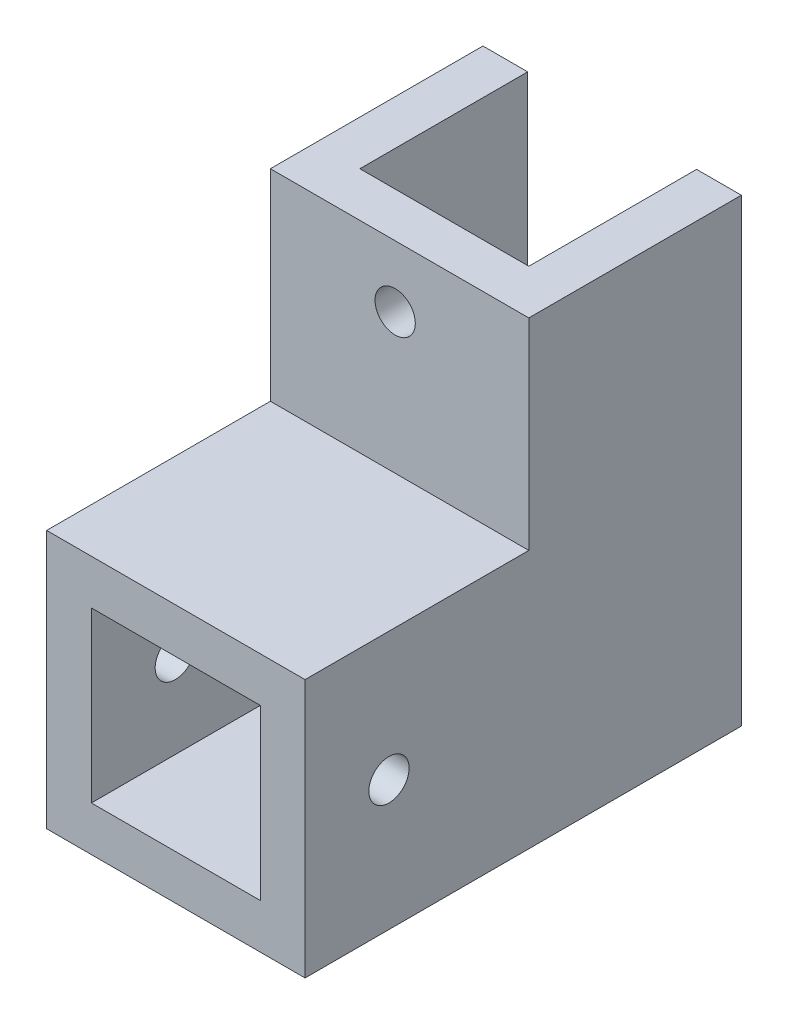
ISO-10303-21;
HEADER;
FILE_DESCRIPTION(('STEP AP214'),'2;1');
FILE_NAME('part.step','',(''),(''),'','','');
FILE_SCHEMA(('AUTOMOTIVE_DESIGN { 1 0 10303 214 1 1 1 1 }'));
ENDSEC;
DATA;
#1=APPLICATION_CONTEXT('core data for automotive mechanical design processes');
#2=APPLICATION_PROTOCOL_DEFINITION('international standard','automotive_design',2000,#1);
#3=PRODUCT_CONTEXT('',#1,'mechanical');
#4=PRODUCT('Part','Part','',(#3));
#5=PRODUCT_RELATED_PRODUCT_CATEGORY('part','',(#4));
#6=PRODUCT_DEFINITION_FORMATION('','',#4);
#7=PRODUCT_DEFINITION_CONTEXT('part definition',#1,'design');
#8=PRODUCT_DEFINITION('design','',#6,#7);
#9=PRODUCT_DEFINITION_SHAPE('','',#8);
#10=(LENGTH_UNIT() NAMED_UNIT(*) SI_UNIT(.MILLI.,.METRE.));
#11=(NAMED_UNIT(*) PLANE_ANGLE_UNIT() SI_UNIT($,.RADIAN.));
#12=(NAMED_UNIT(*) SI_UNIT($,.STERADIAN.) SOLID_ANGLE_UNIT());
#13=UNCERTAINTY_MEASURE_WITH_UNIT(LENGTH_MEASURE(1.E-05),#10,'distance_accuracy_value','');
#14=(GEOMETRIC_REPRESENTATION_CONTEXT(3) GLOBAL_UNCERTAINTY_ASSIGNED_CONTEXT((#13)) GLOBAL_UNIT_ASSIGNED_CONTEXT((#10,
#11,#12)) REPRESENTATION_CONTEXT('',''));
#15=CARTESIAN_POINT('',(0.,0.,0.));
#16=DIRECTION('',(0.,0.,1.));
#17=DIRECTION('',(1.,0.,0.));
#18=AXIS2_PLACEMENT_3D('',#15,#16,#17);
#19=CARTESIAN_POINT('',(-7.15384615384616,20.,0.730769230769229));
#20=DIRECTION('',(0.,0.,1.));
#21=DIRECTION('',(1.,0.,0.));
#22=AXIS2_PLACEMENT_3D('',#19,#20,#21);
#23=PLANE('',#22);
#24=CARTESIAN_POINT('',(0.,12.5,0.730769230769229));
#25=DIRECTION('',(0.,0.,1.));
#26=DIRECTION('',(1.,0.,0.));
#27=AXIS2_PLACEMENT_3D('',#24,#25,#26);
#28=CIRCLE('',#27,1.8);
#29=CARTESIAN_POINT('',(1.8,12.5,0.730769230769229));
#30=VERTEX_POINT('',#29);
#31=EDGE_CURVE('E300',#30,#30,#28,.T.);
#32=ORIENTED_EDGE('',*,*,#31,.T.);
#33=EDGE_LOOP('',(#32));
#34=FACE_BOUND('',#33,.T.);
#35=DIRECTION('',(-1.,0.,0.));
#36=VECTOR('',#35,1.);
#37=CARTESIAN_POINT('',(-7.15384615384616,18.,0.730769230769229));
#38=LINE('',#37,#36);
#39=CARTESIAN_POINT('',(7.94615384615384,18.,0.730769230769229));
#40=VERTEX_POINT('',#39);
#41=CARTESIAN_POINT('',(-7.15384615384616,18.,0.730769230769229));
#42=VERTEX_POINT('',#41);
#43=EDGE_CURVE('E324',#40,#42,#38,.T.);
#44=ORIENTED_EDGE('',*,*,#43,.F.);
#45=DIRECTION('',(0.,-1.,0.));
#46=VECTOR('',#45,1.);
#47=CARTESIAN_POINT('',(7.94615384615384,20.,0.730769230769229));
#48=LINE('',#47,#46);
#49=CARTESIAN_POINT('',(7.94615384615385,-4.,0.730769230769229));
#50=VERTEX_POINT('',#49);
#51=EDGE_CURVE('E191',#40,#50,#48,.T.);
#52=ORIENTED_EDGE('',*,*,#51,.T.);
#53=DIRECTION('',(1.,0.,0.));
#54=VECTOR('',#53,1.);
#55=CARTESIAN_POINT('',(7.94615384615384,-4.,0.730769230769229));
#56=LINE('',#55,#54);
#57=CARTESIAN_POINT('',(-7.15384615384616,-4.,0.730769230769229));
#58=VERTEX_POINT('',#57);
#59=EDGE_CURVE('E238',#58,#50,#56,.T.);
#60=ORIENTED_EDGE('',*,*,#59,.F.);
#61=DIRECTION('',(0.,-1.,0.));
#62=VECTOR('',#61,1.);
#63=CARTESIAN_POINT('',(-7.15384615384616,20.,0.730769230769229));
#64=LINE('',#63,#62);
#65=EDGE_CURVE('E188',#42,#58,#64,.T.);
#66=ORIENTED_EDGE('',*,*,#65,.F.);
#67=EDGE_LOOP('',(#44,#52,#60,#66));
#68=FACE_BOUND('',#67,.T.);
#69=ADVANCED_FACE('F38',(#34,#68),#23,.F.);
#70=CARTESIAN_POINT('',(-11.1538461538462,20.,-14.2692307692308));
#71=DIRECTION('',(1.,0.,0.));
#72=DIRECTION('',(0.,0.,-1.));
#73=AXIS2_PLACEMENT_3D('',#70,#71,#72);
#74=PLANE('',#73);
#75=CARTESIAN_POINT('',(-11.1538461538462,-11.5,17.2307692307692));
#76=DIRECTION('',(1.,0.,0.));
#77=DIRECTION('',(0.,0.,-1.));
#78=AXIS2_PLACEMENT_3D('',#75,#76,#77);
#79=CIRCLE('',#78,1.8);
#80=CARTESIAN_POINT('',(-11.1538461538462,-11.5,15.4307692307692));
#81=VERTEX_POINT('',#80);
#82=EDGE_CURVE('E309',#81,#81,#79,.T.);
#83=ORIENTED_EDGE('',*,*,#82,.T.);
#84=EDGE_LOOP('',(#83));
#85=FACE_BOUND('',#84,.T.);
#86=DIRECTION('',(0.,0.,1.));
#87=VECTOR('',#86,1.);
#88=CARTESIAN_POINT('',(-11.1538461538462,18.,-14.2692307692308));
#89=LINE('',#88,#87);
#90=CARTESIAN_POINT('',(-11.1538461538462,18.,-14.2692307692308));
#91=VERTEX_POINT('',#90);
#92=CARTESIAN_POINT('',(-11.1538461538462,18.,4.73076923076923));
#93=VERTEX_POINT('',#92);
#94=EDGE_CURVE('E138',#91,#93,#89,.T.);
#95=ORIENTED_EDGE('',*,*,#94,.F.);
#96=DIRECTION('',(0.,-1.,0.));
#97=VECTOR('',#96,1.);
#98=CARTESIAN_POINT('',(-11.1538461538462,20.,-14.2692307692308));
#99=LINE('',#98,#97);
#100=CARTESIAN_POINT('',(-11.1538461538462,-23.1,-14.2692307692308));
#101=VERTEX_POINT('',#100);
#102=EDGE_CURVE('E182',#91,#101,#99,.T.);
#103=ORIENTED_EDGE('',*,*,#102,.T.);
#104=DIRECTION('',(0.,0.,-1.));
#105=VECTOR('',#104,1.);
#106=CARTESIAN_POINT('',(-11.1538461538462,-23.1,24.7307692307692));
#107=LINE('',#106,#105);
#108=CARTESIAN_POINT('',(-11.1538461538462,-23.1,24.7307692307692));
#109=VERTEX_POINT('',#108);
#110=EDGE_CURVE('E164',#109,#101,#107,.T.);
#111=ORIENTED_EDGE('',*,*,#110,.F.);
#112=DIRECTION('',(0.,1.,0.));
#113=VECTOR('',#112,1.);
#114=CARTESIAN_POINT('',(-11.1538461538462,0.,24.7307692307692));
#115=LINE('',#114,#113);
#116=CARTESIAN_POINT('',(-11.1538461538462,0.,24.7307692307692));
#117=VERTEX_POINT('',#116);
#118=EDGE_CURVE('E158',#109,#117,#115,.T.);
#119=ORIENTED_EDGE('',*,*,#118,.T.);
#120=DIRECTION('',(0.,0.,-1.));
#121=VECTOR('',#120,1.);
#122=CARTESIAN_POINT('',(-11.1538461538462,0.,24.7307692307692));
#123=LINE('',#122,#121);
#124=CARTESIAN_POINT('',(-11.1538461538462,0.,4.73076923076923));
#125=VERTEX_POINT('',#124);
#126=EDGE_CURVE('E156',#117,#125,#123,.T.);
#127=ORIENTED_EDGE('',*,*,#126,.T.);
#128=DIRECTION('',(0.,-1.,0.));
#129=VECTOR('',#128,1.);
#130=CARTESIAN_POINT('',(-11.1538461538462,20.,4.73076923076923));
#131=LINE('',#130,#129);
#132=EDGE_CURVE('E11',#93,#125,#131,.T.);
#133=ORIENTED_EDGE('',*,*,#132,.F.);
#134=EDGE_LOOP('',(#95,#103,#111,#119,#127,#133));
#135=FACE_BOUND('',#134,.T.);
#136=ADVANCED_FACE('F40',(#85,#135),#74,.F.);
#137=CARTESIAN_POINT('',(-7.38461538461538,20.,4.73076923076923));
#138=DIRECTION('',(0.,0.,-1.));
#139=DIRECTION('',(-1.,0.,0.));
#140=AXIS2_PLACEMENT_3D('',#137,#138,#139);
#141=PLANE('',#140);
#142=CARTESIAN_POINT('',(0.,12.5,4.73076923076923));
#143=DIRECTION('',(0.,0.,1.));
#144=DIRECTION('',(1.,0.,0.));
#145=AXIS2_PLACEMENT_3D('',#142,#143,#144);
#146=CIRCLE('',#145,1.8);
#147=CARTESIAN_POINT('',(1.8,12.5,4.73076923076923));
#148=VERTEX_POINT('',#147);
#149=EDGE_CURVE('E305',#148,#148,#146,.T.);
#150=ORIENTED_EDGE('',*,*,#149,.F.);
#151=EDGE_LOOP('',(#150));
#152=FACE_BOUND('',#151,.T.);
#153=DIRECTION('',(1.,0.,0.));
#154=VECTOR('',#153,1.);
#155=CARTESIAN_POINT('',(-11.1538461538462,18.,4.73076923076923));
#156=LINE('',#155,#154);
#157=CARTESIAN_POINT('',(11.9461538461538,18.,4.73076923076923));
#158=VERTEX_POINT('',#157);
#159=EDGE_CURVE('E141',#93,#158,#156,.T.);
#160=ORIENTED_EDGE('',*,*,#159,.F.);
#161=ORIENTED_EDGE('',*,*,#132,.T.);
#162=DIRECTION('',(1.,0.,0.));
#163=VECTOR('',#162,1.);
#164=CARTESIAN_POINT('',(-7.38461538461538,0.,4.73076923076923));
#165=LINE('',#164,#163);
#166=CARTESIAN_POINT('',(11.9461538461538,0.,4.73076923076923));
#167=VERTEX_POINT('',#166);
#168=EDGE_CURVE('E169',#125,#167,#165,.T.);
#169=ORIENTED_EDGE('',*,*,#168,.T.);
#170=DIRECTION('',(0.,-1.,0.));
#171=VECTOR('',#170,1.);
#172=CARTESIAN_POINT('',(11.9461538461538,20.,4.73076923076923));
#173=LINE('',#172,#171);
#174=EDGE_CURVE('E48',#158,#167,#173,.T.);
#175=ORIENTED_EDGE('',*,*,#174,.F.);
#176=EDGE_LOOP('',(#160,#161,#169,#175));
#177=FACE_BOUND('',#176,.T.);
#178=ADVANCED_FACE('F149',(#152,#177),#141,.F.);
#179=CARTESIAN_POINT('',(11.9461538461538,20.,0.730769230769228));
#180=DIRECTION('',(-1.,0.,0.));
#181=DIRECTION('',(0.,0.,1.));
#182=AXIS2_PLACEMENT_3D('',#179,#180,#181);
#183=PLANE('',#182);
#184=CARTESIAN_POINT('',(11.9461538461538,-11.5,17.2307692307692));
#185=DIRECTION('',(1.,0.,0.));
#186=DIRECTION('',(0.,0.,-1.));
#187=AXIS2_PLACEMENT_3D('',#184,#185,#186);
#188=CIRCLE('',#187,1.8);
#189=CARTESIAN_POINT('',(11.9461538461538,-11.5,15.4307692307692));
#190=VERTEX_POINT('',#189);
#191=EDGE_CURVE('E317',#190,#190,#188,.T.);
#192=ORIENTED_EDGE('',*,*,#191,.F.);
#193=EDGE_LOOP('',(#192));
#194=FACE_BOUND('',#193,.T.);
#195=DIRECTION('',(0.,0.,-1.));
#196=VECTOR('',#195,1.);
#197=CARTESIAN_POINT('',(11.9461538461538,18.,-14.2692307692308));
#198=LINE('',#197,#196);
#199=CARTESIAN_POINT('',(11.9461538461538,18.,-14.2692307692308));
#200=VERTEX_POINT('',#199);
#201=EDGE_CURVE('E152',#158,#200,#198,.T.);
#202=ORIENTED_EDGE('',*,*,#201,.F.);
#203=ORIENTED_EDGE('',*,*,#174,.T.);
#204=DIRECTION('',(0.,0.,-1.));
#205=VECTOR('',#204,1.);
#206=CARTESIAN_POINT('',(11.9461538461538,0.,24.7307692307692));
#207=LINE('',#206,#205);
#208=CARTESIAN_POINT('',(11.9461538461538,0.,24.7307692307692));
#209=VERTEX_POINT('',#208);
#210=EDGE_CURVE('E163',#209,#167,#207,.T.);
#211=ORIENTED_EDGE('',*,*,#210,.F.);
#212=DIRECTION('',(0.,-1.,0.));
#213=VECTOR('',#212,1.);
#214=CARTESIAN_POINT('',(11.9461538461538,0.,24.7307692307692));
#215=LINE('',#214,#213);
#216=CARTESIAN_POINT('',(11.9461538461538,-23.1,24.7307692307692));
#217=VERTEX_POINT('',#216);
#218=EDGE_CURVE('E214',#209,#217,#215,.T.);
#219=ORIENTED_EDGE('',*,*,#218,.T.);
#220=DIRECTION('',(0.,0.,-1.));
#221=VECTOR('',#220,1.);
#222=CARTESIAN_POINT('',(11.9461538461538,-23.1,24.7307692307692));
#223=LINE('',#222,#221);
#224=CARTESIAN_POINT('',(11.9461538461538,-23.1,-14.2692307692308));
#225=VERTEX_POINT('',#224);
#226=EDGE_CURVE('E172',#217,#225,#223,.T.);
#227=ORIENTED_EDGE('',*,*,#226,.T.);
#228=DIRECTION('',(0.,-1.,0.));
#229=VECTOR('',#228,1.);
#230=CARTESIAN_POINT('',(11.9461538461538,20.,-14.2692307692308));
#231=LINE('',#230,#229);
#232=EDGE_CURVE('E197',#200,#225,#231,.T.);
#233=ORIENTED_EDGE('',*,*,#232,.F.);
#234=EDGE_LOOP('',(#202,#203,#211,#219,#227,#233));
#235=FACE_BOUND('',#234,.T.);
#236=ADVANCED_FACE('F212',(#194,#235),#183,.F.);
#237=CARTESIAN_POINT('',(11.9461538461538,20.,-14.2692307692308));
#238=DIRECTION('',(0.,0.,1.));
#239=DIRECTION('',(1.,0.,0.));
#240=AXIS2_PLACEMENT_3D('',#237,#238,#239);
#241=PLANE('',#240);
#242=DIRECTION('',(-1.,0.,0.));
#243=VECTOR('',#242,1.);
#244=CARTESIAN_POINT('',(-11.1538461538462,18.,-14.2692307692308));
#245=LINE('',#244,#243);
#246=CARTESIAN_POINT('',(7.94615384615384,18.,-14.2692307692308));
#247=VERTEX_POINT('',#246);
#248=EDGE_CURVE('E210',#200,#247,#245,.T.);
#249=ORIENTED_EDGE('',*,*,#248,.F.);
#250=ORIENTED_EDGE('',*,*,#232,.T.);
#251=DIRECTION('',(-1.,0.,0.));
#252=VECTOR('',#251,1.);
#253=CARTESIAN_POINT('',(11.9461538461538,-23.1,-14.2692307692308));
#254=LINE('',#253,#252);
#255=CARTESIAN_POINT('',(7.94615384615384,-23.1,-14.2692307692308));
#256=VERTEX_POINT('',#255);
#257=EDGE_CURVE('E208',#225,#256,#254,.T.);
#258=ORIENTED_EDGE('',*,*,#257,.T.);
#259=DIRECTION('',(0.,-1.,0.));
#260=VECTOR('',#259,1.);
#261=CARTESIAN_POINT('',(7.94615384615384,20.,-14.2692307692308));
#262=LINE('',#261,#260);
#263=EDGE_CURVE('E194',#247,#256,#262,.T.);
#264=ORIENTED_EDGE('',*,*,#263,.F.);
#265=EDGE_LOOP('',(#249,#250,#258,#264));
#266=FACE_BOUND('',#265,.T.);
#267=ADVANCED_FACE('F205',(#266),#241,.F.);
#268=CARTESIAN_POINT('',(7.94615384615384,20.,0.730769230769229));
#269=DIRECTION('',(1.,0.,0.));
#270=DIRECTION('',(0.,0.,-1.));
#271=AXIS2_PLACEMENT_3D('',#268,#269,#270);
#272=PLANE('',#271);
#273=CARTESIAN_POINT('',(7.94615384615384,-11.5,17.2307692307692));
#274=DIRECTION('',(1.,0.,0.));
#275=DIRECTION('',(0.,0.,-1.));
#276=AXIS2_PLACEMENT_3D('',#273,#274,#275);
#277=CIRCLE('',#276,1.8);
#278=CARTESIAN_POINT('',(7.94615384615384,-11.5,15.4307692307692));
#279=VERTEX_POINT('',#278);
#280=EDGE_CURVE('E313',#279,#279,#277,.T.);
#281=ORIENTED_EDGE('',*,*,#280,.T.);
#282=EDGE_LOOP('',(#281));
#283=FACE_BOUND('',#282,.T.);
#284=DIRECTION('',(0.,0.,1.));
#285=VECTOR('',#284,1.);
#286=CARTESIAN_POINT('',(7.94615384615384,18.,0.730769230769229));
#287=LINE('',#286,#285);
#288=EDGE_CURVE('E321',#247,#40,#287,.T.);
#289=ORIENTED_EDGE('',*,*,#288,.F.);
#290=ORIENTED_EDGE('',*,*,#263,.T.);
#291=DIRECTION('',(0.,0.,1.));
#292=VECTOR('',#291,1.);
#293=CARTESIAN_POINT('',(7.94615384615384,-23.1,-14.2692307692308));
#294=LINE('',#293,#292);
#295=CARTESIAN_POINT('',(7.94615384615384,-23.1,0.730769230769229));
#296=VERTEX_POINT('',#295);
#297=EDGE_CURVE('E220',#256,#296,#294,.T.);
#298=ORIENTED_EDGE('',*,*,#297,.T.);
#299=DIRECTION('',(0.,1.,0.));
#300=VECTOR('',#299,1.);
#301=CARTESIAN_POINT('',(7.94615384615385,0.,0.730769230769229));
#302=LINE('',#301,#300);
#303=CARTESIAN_POINT('',(7.94615384615384,-19.1,0.730769230769229));
#304=VERTEX_POINT('',#303);
#305=EDGE_CURVE('E222',#296,#304,#302,.T.);
#306=ORIENTED_EDGE('',*,*,#305,.T.);
#307=DIRECTION('',(0.,0.,-1.));
#308=VECTOR('',#307,1.);
#309=CARTESIAN_POINT('',(7.94615384615384,-19.1,24.7307692307692));
#310=LINE('',#309,#308);
#311=CARTESIAN_POINT('',(7.94615384615384,-19.1,24.7307692307692));
#312=VERTEX_POINT('',#311);
#313=EDGE_CURVE('E250',#312,#304,#310,.T.);
#314=ORIENTED_EDGE('',*,*,#313,.F.);
#315=DIRECTION('',(0.,-1.,0.));
#316=VECTOR('',#315,1.);
#317=CARTESIAN_POINT('',(7.94615384615384,-4.,24.7307692307692));
#318=LINE('',#317,#316);
#319=CARTESIAN_POINT('',(7.94615384615384,-4.,24.7307692307692));
#320=VERTEX_POINT('',#319);
#321=EDGE_CURVE('E233',#320,#312,#318,.T.);
#322=ORIENTED_EDGE('',*,*,#321,.F.);
#323=DIRECTION('',(0.,0.,-1.));
#324=VECTOR('',#323,1.);
#325=CARTESIAN_POINT('',(7.94615384615384,-4.,24.7307692307692));
#326=LINE('',#325,#324);
#327=EDGE_CURVE('E257',#320,#50,#326,.T.);
#328=ORIENTED_EDGE('',*,*,#327,.T.);
#329=ORIENTED_EDGE('',*,*,#51,.F.);
#330=EDGE_LOOP('',(#289,#290,#298,#306,#314,#322,#328,#329));
#331=FACE_BOUND('',#330,.T.);
#332=ADVANCED_FACE('F374',(#283,#331),#272,.F.);
#333=CARTESIAN_POINT('',(-7.15384615384616,20.,-14.2692307692308));
#334=DIRECTION('',(-1.,0.,0.));
#335=DIRECTION('',(0.,0.,1.));
#336=AXIS2_PLACEMENT_3D('',#333,#334,#335);
#337=PLANE('',#336);
#338=CARTESIAN_POINT('',(-7.15384615384615,-11.5,17.2307692307692));
#339=DIRECTION('',(-1.,0.,0.));
#340=DIRECTION('',(0.,0.,1.));
#341=AXIS2_PLACEMENT_3D('',#338,#339,#340);
#342=CIRCLE('',#341,1.8);
#343=CARTESIAN_POINT('',(-7.15384615384615,-11.5,19.0307692307692));
#344=VERTEX_POINT('',#343);
#345=EDGE_CURVE('E42',#344,#344,#342,.T.);
#346=ORIENTED_EDGE('',*,*,#345,.T.);
#347=EDGE_LOOP('',(#346));
#348=FACE_BOUND('',#347,.T.);
#349=DIRECTION('',(0.,0.,-1.));
#350=VECTOR('',#349,1.);
#351=CARTESIAN_POINT('',(-7.15384615384616,18.,-14.2692307692308));
#352=LINE('',#351,#350);
#353=CARTESIAN_POINT('',(-7.15384615384616,18.,-14.2692307692308));
#354=VERTEX_POINT('',#353);
#355=EDGE_CURVE('E55',#42,#354,#352,.T.);
#356=ORIENTED_EDGE('',*,*,#355,.F.);
#357=ORIENTED_EDGE('',*,*,#65,.T.);
#358=DIRECTION('',(0.,0.,-1.));
#359=VECTOR('',#358,1.);
#360=CARTESIAN_POINT('',(-7.15384615384616,-4.,24.7307692307692));
#361=LINE('',#360,#359);
#362=CARTESIAN_POINT('',(-7.15384615384616,-4.,24.7307692307692));
#363=VERTEX_POINT('',#362);
#364=EDGE_CURVE('E262',#363,#58,#361,.T.);
#365=ORIENTED_EDGE('',*,*,#364,.F.);
#366=DIRECTION('',(0.,1.,0.));
#367=VECTOR('',#366,1.);
#368=CARTESIAN_POINT('',(-7.15384615384616,-4.,24.7307692307692));
#369=LINE('',#368,#367);
#370=CARTESIAN_POINT('',(-7.15384615384616,-19.1,24.7307692307692));
#371=VERTEX_POINT('',#370);
#372=EDGE_CURVE('E242',#371,#363,#369,.T.);
#373=ORIENTED_EDGE('',*,*,#372,.F.);
#374=DIRECTION('',(0.,0.,-1.));
#375=VECTOR('',#374,1.);
#376=CARTESIAN_POINT('',(-7.15384615384616,-19.1,24.7307692307692));
#377=LINE('',#376,#375);
#378=CARTESIAN_POINT('',(-7.15384615384616,-19.1,0.730769230769229));
#379=VERTEX_POINT('',#378);
#380=EDGE_CURVE('E266',#371,#379,#377,.T.);
#381=ORIENTED_EDGE('',*,*,#380,.T.);
#382=DIRECTION('',(0.,-1.,0.));
#383=VECTOR('',#382,1.);
#384=CARTESIAN_POINT('',(-7.15384615384616,0.,0.730769230769229));
#385=LINE('',#384,#383);
#386=CARTESIAN_POINT('',(-7.15384615384616,-23.1,0.730769230769229));
#387=VERTEX_POINT('',#386);
#388=EDGE_CURVE('E287',#379,#387,#385,.T.);
#389=ORIENTED_EDGE('',*,*,#388,.T.);
#390=DIRECTION('',(0.,0.,1.));
#391=VECTOR('',#390,1.);
#392=CARTESIAN_POINT('',(-7.15384615384616,-23.1,-14.2692307692308));
#393=LINE('',#392,#391);
#394=CARTESIAN_POINT('',(-7.15384615384616,-23.1,-14.2692307692308));
#395=VERTEX_POINT('',#394);
#396=EDGE_CURVE('E228',#395,#387,#393,.T.);
#397=ORIENTED_EDGE('',*,*,#396,.F.);
#398=DIRECTION('',(0.,-1.,0.));
#399=VECTOR('',#398,1.);
#400=CARTESIAN_POINT('',(-7.15384615384616,20.,-14.2692307692308));
#401=LINE('',#400,#399);
#402=EDGE_CURVE('E185',#354,#395,#401,.T.);
#403=ORIENTED_EDGE('',*,*,#402,.F.);
#404=EDGE_LOOP('',(#356,#357,#365,#373,#381,#389,#397,#403));
#405=FACE_BOUND('',#404,.T.);
#406=ADVANCED_FACE('F337',(#348,#405),#337,.F.);
#407=CARTESIAN_POINT('',(-11.1538461538462,20.,-14.2692307692308));
#408=DIRECTION('',(0.,0.,1.));
#409=DIRECTION('',(1.,0.,0.));
#410=AXIS2_PLACEMENT_3D('',#407,#408,#409);
#411=PLANE('',#410);
#412=EDGE_CURVE('E142',#354,#91,#245,.T.);
#413=ORIENTED_EDGE('',*,*,#412,.F.);
#414=ORIENTED_EDGE('',*,*,#402,.T.);
#415=DIRECTION('',(-1.,0.,0.));
#416=VECTOR('',#415,1.);
#417=CARTESIAN_POINT('',(-11.1538461538462,-23.1,-14.2692307692308));
#418=LINE('',#417,#416);
#419=EDGE_CURVE('E292',#395,#101,#418,.T.);
#420=ORIENTED_EDGE('',*,*,#419,.T.);
#421=ORIENTED_EDGE('',*,*,#102,.F.);
#422=EDGE_LOOP('',(#413,#414,#420,#421));
#423=FACE_BOUND('',#422,.T.);
#424=ADVANCED_FACE('F363',(#423),#411,.F.);
#425=ORIENTED_EDGE('',*,*,#388,.F.);
#426=DIRECTION('',(-1.,0.,0.));
#427=VECTOR('',#426,1.);
#428=CARTESIAN_POINT('',(7.94615384615384,-19.1,0.730769230769229));
#429=LINE('',#428,#427);
#430=EDGE_CURVE('E226',#304,#379,#429,.T.);
#431=ORIENTED_EDGE('',*,*,#430,.F.);
#432=ORIENTED_EDGE('',*,*,#305,.F.);
#433=DIRECTION('',(-1.,0.,0.));
#434=VECTOR('',#433,1.);
#435=CARTESIAN_POINT('',(11.9461538461538,-23.1,0.730769230769229));
#436=LINE('',#435,#434);
#437=EDGE_CURVE('E261',#296,#387,#436,.T.);
#438=ORIENTED_EDGE('',*,*,#437,.T.);
#439=EDGE_LOOP('',(#425,#431,#432,#438));
#440=FACE_BOUND('',#439,.T.);
#441=ADVANCED_FACE('F285',(#440),#23,.F.);
#442=CARTESIAN_POINT('',(11.9461538461538,0.,24.7307692307692));
#443=DIRECTION('',(0.,1.,0.));
#444=DIRECTION('',(-1.,0.,0.));
#445=AXIS2_PLACEMENT_3D('',#442,#443,#444);
#446=PLANE('',#445);
#447=ORIENTED_EDGE('',*,*,#168,.F.);
#448=ORIENTED_EDGE('',*,*,#126,.F.);
#449=DIRECTION('',(1.,0.,0.));
#450=VECTOR('',#449,1.);
#451=CARTESIAN_POINT('',(11.9461538461538,0.,24.7307692307692));
#452=LINE('',#451,#450);
#453=EDGE_CURVE('E179',#117,#209,#452,.T.);
#454=ORIENTED_EDGE('',*,*,#453,.T.);
#455=ORIENTED_EDGE('',*,*,#210,.T.);
#456=EDGE_LOOP('',(#447,#448,#454,#455));
#457=FACE_BOUND('',#456,.T.);
#458=ADVANCED_FACE('F362',(#457),#446,.T.);
#459=CARTESIAN_POINT('',(11.9461538461538,-23.1,24.7307692307692));
#460=DIRECTION('',(0.,-1.,0.));
#461=DIRECTION('',(0.,0.,-1.));
#462=AXIS2_PLACEMENT_3D('',#459,#460,#461);
#463=PLANE('',#462);
#464=ORIENTED_EDGE('',*,*,#437,.F.);
#465=ORIENTED_EDGE('',*,*,#297,.F.);
#466=ORIENTED_EDGE('',*,*,#257,.F.);
#467=ORIENTED_EDGE('',*,*,#226,.F.);
#468=DIRECTION('',(-1.,0.,0.));
#469=VECTOR('',#468,1.);
#470=CARTESIAN_POINT('',(11.9461538461538,-23.1,24.7307692307692));
#471=LINE('',#470,#469);
#472=EDGE_CURVE('E275',#217,#109,#471,.T.);
#473=ORIENTED_EDGE('',*,*,#472,.T.);
#474=ORIENTED_EDGE('',*,*,#110,.T.);
#475=ORIENTED_EDGE('',*,*,#419,.F.);
#476=ORIENTED_EDGE('',*,*,#396,.T.);
#477=EDGE_LOOP('',(#464,#465,#466,#467,#473,#474,#475,#476));
#478=FACE_BOUND('',#477,.T.);
#479=ADVANCED_FACE('F219',(#478),#463,.T.);
#480=CARTESIAN_POINT('',(0.,0.,24.7307692307692));
#481=DIRECTION('',(0.,0.,-1.));
#482=DIRECTION('',(-1.,0.,0.));
#483=AXIS2_PLACEMENT_3D('',#480,#481,#482);
#484=PLANE('',#483);
#485=DIRECTION('',(1.,0.,0.));
#486=VECTOR('',#485,1.);
#487=CARTESIAN_POINT('',(7.94615384615384,-4.,24.7307692307692));
#488=LINE('',#487,#486);
#489=EDGE_CURVE('E246',#363,#320,#488,.T.);
#490=ORIENTED_EDGE('',*,*,#489,.T.);
#491=ORIENTED_EDGE('',*,*,#321,.T.);
#492=DIRECTION('',(-1.,0.,0.));
#493=VECTOR('',#492,1.);
#494=CARTESIAN_POINT('',(7.94615384615384,-19.1,24.7307692307692));
#495=LINE('',#494,#493);
#496=EDGE_CURVE('E237',#312,#371,#495,.T.);
#497=ORIENTED_EDGE('',*,*,#496,.T.);
#498=ORIENTED_EDGE('',*,*,#372,.T.);
#499=EDGE_LOOP('',(#490,#491,#497,#498));
#500=FACE_BOUND('',#499,.T.);
#501=ORIENTED_EDGE('',*,*,#218,.F.);
#502=ORIENTED_EDGE('',*,*,#453,.F.);
#503=ORIENTED_EDGE('',*,*,#118,.F.);
#504=ORIENTED_EDGE('',*,*,#472,.F.);
#505=EDGE_LOOP('',(#501,#502,#503,#504));
#506=FACE_BOUND('',#505,.T.);
#507=ADVANCED_FACE('F377',(#500,#506),#484,.F.);
#508=CARTESIAN_POINT('',(7.94615384615384,-4.,24.7307692307692));
#509=DIRECTION('',(0.,1.,0.));
#510=DIRECTION('',(0.,0.,1.));
#511=AXIS2_PLACEMENT_3D('',#508,#509,#510);
#512=PLANE('',#511);
#513=ORIENTED_EDGE('',*,*,#59,.T.);
#514=ORIENTED_EDGE('',*,*,#327,.F.);
#515=ORIENTED_EDGE('',*,*,#489,.F.);
#516=ORIENTED_EDGE('',*,*,#364,.T.);
#517=EDGE_LOOP('',(#513,#514,#515,#516));
#518=FACE_BOUND('',#517,.T.);
#519=ADVANCED_FACE('F381',(#518),#512,.F.);
#520=CARTESIAN_POINT('',(7.94615384615384,-19.1,24.7307692307692));
#521=DIRECTION('',(0.,-1.,0.));
#522=DIRECTION('',(1.,0.,0.));
#523=AXIS2_PLACEMENT_3D('',#520,#521,#522);
#524=PLANE('',#523);
#525=ORIENTED_EDGE('',*,*,#430,.T.);
#526=ORIENTED_EDGE('',*,*,#380,.F.);
#527=ORIENTED_EDGE('',*,*,#496,.F.);
#528=ORIENTED_EDGE('',*,*,#313,.T.);
#529=EDGE_LOOP('',(#525,#526,#527,#528));
#530=FACE_BOUND('',#529,.T.);
#531=ADVANCED_FACE('F383',(#530),#524,.F.);
#532=CARTESIAN_POINT('',(0.,12.5,-10.2692307692308));
#533=DIRECTION('',(0.,0.,1.));
#534=DIRECTION('',(1.,0.,0.));
#535=AXIS2_PLACEMENT_3D('',#532,#533,#534);
#536=CYLINDRICAL_SURFACE('',#535,1.8);
#537=ORIENTED_EDGE('',*,*,#149,.T.);
#538=EDGE_LOOP('',(#537));
#539=FACE_BOUND('',#538,.T.);
#540=ORIENTED_EDGE('',*,*,#31,.F.);
#541=EDGE_LOOP('',(#540));
#542=FACE_BOUND('',#541,.T.);
#543=ADVANCED_FACE('F343',(#539,#542),#536,.F.);
#544=CARTESIAN_POINT('',(-23.0538461538462,-11.5,17.2307692307692));
#545=DIRECTION('',(1.,0.,0.));
#546=DIRECTION('',(0.,0.,-1.));
#547=AXIS2_PLACEMENT_3D('',#544,#545,#546);
#548=CYLINDRICAL_SURFACE('',#547,1.8);
#549=ORIENTED_EDGE('',*,*,#345,.F.);
#550=EDGE_LOOP('',(#549));
#551=FACE_BOUND('',#550,.T.);
#552=ORIENTED_EDGE('',*,*,#82,.F.);
#553=EDGE_LOOP('',(#552));
#554=FACE_BOUND('',#553,.T.);
#555=ADVANCED_FACE('F339',(#551,#554),#548,.F.);
#556=ORIENTED_EDGE('',*,*,#191,.T.);
#557=EDGE_LOOP('',(#556));
#558=FACE_BOUND('',#557,.T.);
#559=ORIENTED_EDGE('',*,*,#280,.F.);
#560=EDGE_LOOP('',(#559));
#561=FACE_BOUND('',#560,.T.);
#562=ADVANCED_FACE('F342',(#558,#561),#548,.F.);
#563=CARTESIAN_POINT('',(0.,18.,0.));
#564=DIRECTION('',(0.,1.,0.));
#565=DIRECTION('',(0.,0.,1.));
#566=AXIS2_PLACEMENT_3D('',#563,#564,#565);
#567=PLANE('',#566);
#568=ORIENTED_EDGE('',*,*,#288,.T.);
#569=ORIENTED_EDGE('',*,*,#43,.T.);
#570=ORIENTED_EDGE('',*,*,#355,.T.);
#571=ORIENTED_EDGE('',*,*,#412,.T.);
#572=ORIENTED_EDGE('',*,*,#94,.T.);
#573=ORIENTED_EDGE('',*,*,#159,.T.);
#574=ORIENTED_EDGE('',*,*,#201,.T.);
#575=ORIENTED_EDGE('',*,*,#248,.T.);
#576=EDGE_LOOP('',(#568,#569,#570,#571,#572,#573,#574,#575));
#577=FACE_BOUND('',#576,.T.);
#578=ADVANCED_FACE('F140',(#577),#567,.T.);
#579=CLOSED_SHELL('',(#69,#136,#178,#236,#267,#332,#406,#424,#441,#458,#479,#507,#519,#531,#543,
#555,#562,#578));
#580=MANIFOLD_SOLID_BREP('B2',#579);
#581=ADVANCED_BREP_SHAPE_REPRESENTATION('',(#18,#580),#14);
#582=SHAPE_DEFINITION_REPRESENTATION(#9,#581);
ENDSEC;
END-ISO-10303-21;
